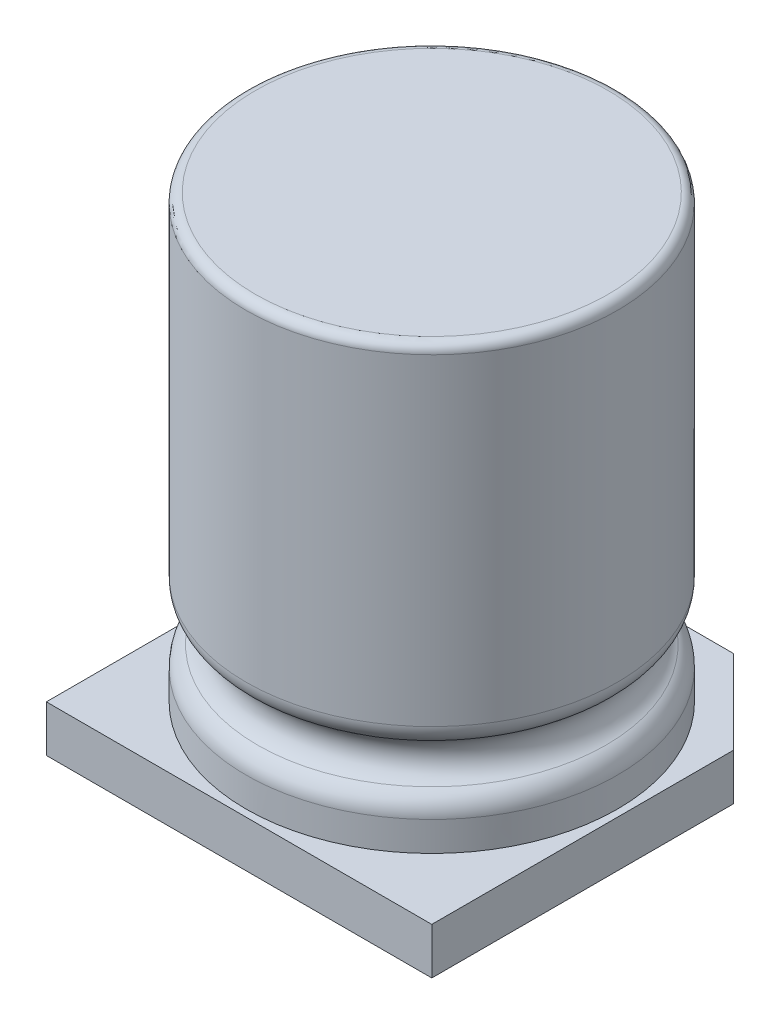
ISO-10303-21;
HEADER;
FILE_DESCRIPTION(('STEP AP214'),'2;1');
FILE_NAME('part.step','',(''),(''),'','','');
FILE_SCHEMA(('AUTOMOTIVE_DESIGN { 1 0 10303 214 1 1 1 1 }'));
ENDSEC;
DATA;
#1=APPLICATION_CONTEXT('core data for automotive mechanical design processes');
#2=APPLICATION_PROTOCOL_DEFINITION('international standard','automotive_design',2000,#1);
#3=PRODUCT_CONTEXT('',#1,'mechanical');
#4=PRODUCT('Part','Part','',(#3));
#5=PRODUCT_RELATED_PRODUCT_CATEGORY('part','',(#4));
#6=PRODUCT_DEFINITION_FORMATION('','',#4);
#7=PRODUCT_DEFINITION_CONTEXT('part definition',#1,'design');
#8=PRODUCT_DEFINITION('design','',#6,#7);
#9=PRODUCT_DEFINITION_SHAPE('','',#8);
#10=(LENGTH_UNIT() NAMED_UNIT(*) SI_UNIT(.MILLI.,.METRE.));
#11=(NAMED_UNIT(*) PLANE_ANGLE_UNIT() SI_UNIT($,.RADIAN.));
#12=(NAMED_UNIT(*) SI_UNIT($,.STERADIAN.) SOLID_ANGLE_UNIT());
#13=UNCERTAINTY_MEASURE_WITH_UNIT(LENGTH_MEASURE(1.E-05),#10,'distance_accuracy_value','');
#14=(GEOMETRIC_REPRESENTATION_CONTEXT(3) GLOBAL_UNCERTAINTY_ASSIGNED_CONTEXT((#13)) GLOBAL_UNIT_ASSIGNED_CONTEXT((#10,
#11,#12)) REPRESENTATION_CONTEXT('',''));
#15=CARTESIAN_POINT('',(0.,0.,0.));
#16=DIRECTION('',(0.,0.,1.));
#17=DIRECTION('',(1.,0.,0.));
#18=AXIS2_PLACEMENT_3D('',#15,#16,#17);
#19=CARTESIAN_POINT('',(0.,10.5,0.));
#20=DIRECTION('',(0.,-1.,0.));
#21=DIRECTION('',(0.,0.,-1.));
#22=AXIS2_PLACEMENT_3D('',#19,#20,#21);
#23=CYLINDRICAL_SURFACE('',#22,4.);
#24=CARTESIAN_POINT('',(0.,10.3,0.));
#25=DIRECTION('',(0.,1.,0.));
#26=DIRECTION('',(0.,0.,1.));
#27=AXIS2_PLACEMENT_3D('',#24,#25,#26);
#28=CIRCLE('',#27,4.);
#29=CARTESIAN_POINT('',(0.,10.3,4.));
#30=VERTEX_POINT('',#29);
#31=EDGE_CURVE('E11',#30,#30,#28,.F.);
#32=ORIENTED_EDGE('',*,*,#31,.T.);
#33=EDGE_LOOP('',(#32));
#34=FACE_BOUND('',#33,.T.);
#35=CARTESIAN_POINT('',(0.,3.36602540378466,0.));
#36=DIRECTION('',(0.,1.,0.));
#37=DIRECTION('',(0.,0.,1.));
#38=AXIS2_PLACEMENT_3D('',#35,#36,#37);
#39=CIRCLE('',#38,4.);
#40=CARTESIAN_POINT('',(0.,3.36602540378466,4.));
#41=VERTEX_POINT('',#40);
#42=EDGE_CURVE('E55',#41,#41,#39,.T.);
#43=ORIENTED_EDGE('',*,*,#42,.T.);
#44=EDGE_LOOP('',(#43));
#45=FACE_BOUND('',#44,.T.);
#46=ADVANCED_FACE('F40',(#34,#45),#23,.T.);
#47=CARTESIAN_POINT('',(0.,10.5,0.));
#48=DIRECTION('',(0.,1.,0.));
#49=DIRECTION('',(0.,0.,1.));
#50=AXIS2_PLACEMENT_3D('',#47,#48,#49);
#51=PLANE('',#50);
#52=CARTESIAN_POINT('',(0.,10.5,0.));
#53=DIRECTION('',(0.,1.,0.));
#54=DIRECTION('',(0.,0.,1.));
#55=AXIS2_PLACEMENT_3D('',#52,#53,#54);
#56=CIRCLE('',#55,3.8);
#57=CARTESIAN_POINT('',(0.,10.5,3.8));
#58=VERTEX_POINT('',#57);
#59=EDGE_CURVE('E47',#58,#58,#56,.T.);
#60=ORIENTED_EDGE('',*,*,#59,.T.);
#61=EDGE_LOOP('',(#60));
#62=FACE_BOUND('',#61,.T.);
#63=ADVANCED_FACE('F83',(#62),#51,.T.);
#64=CARTESIAN_POINT('',(0.,2.5,0.));
#65=DIRECTION('',(0.,1.,0.));
#66=DIRECTION('',(0.,0.,1.));
#67=AXIS2_PLACEMENT_3D('',#64,#65,#66);
#68=TOROIDAL_SURFACE('',#67,4.,0.5);
#69=CARTESIAN_POINT('',(0.,2.93301270189225,0.));
#70=DIRECTION('',(0.,-1.,0.));
#71=DIRECTION('',(0.,0.,-1.));
#72=AXIS2_PLACEMENT_3D('',#69,#70,#71);
#73=CIRCLE('',#72,3.75000000000008);
#74=CARTESIAN_POINT('',(0.,2.93301270189225,-3.75000000000008));
#75=VERTEX_POINT('',#74);
#76=EDGE_CURVE('E60',#75,#75,#73,.T.);
#77=ORIENTED_EDGE('',*,*,#76,.T.);
#78=EDGE_LOOP('',(#77));
#79=FACE_BOUND('',#78,.T.);
#80=CARTESIAN_POINT('',(0.,2.06698729810775,0.));
#81=DIRECTION('',(0.,1.,0.));
#82=DIRECTION('',(0.,0.,1.));
#83=AXIS2_PLACEMENT_3D('',#80,#81,#82);
#84=CIRCLE('',#83,3.75000000000008);
#85=CARTESIAN_POINT('',(0.,2.06698729810775,3.75000000000008));
#86=VERTEX_POINT('',#85);
#87=EDGE_CURVE('E63',#86,#86,#84,.T.);
#88=ORIENTED_EDGE('',*,*,#87,.T.);
#89=EDGE_LOOP('',(#88));
#90=FACE_BOUND('',#89,.T.);
#91=ADVANCED_FACE('F74',(#79,#90),#68,.F.);
#92=CARTESIAN_POINT('',(0.,1.,0.));
#93=DIRECTION('',(0.,1.,0.));
#94=DIRECTION('',(0.,0.,1.));
#95=AXIS2_PLACEMENT_3D('',#92,#93,#94);
#96=PLANE('',#95);
#97=CARTESIAN_POINT('',(0.,1.,0.));
#98=DIRECTION('',(0.,1.,0.));
#99=DIRECTION('',(0.,0.,1.));
#100=AXIS2_PLACEMENT_3D('',#97,#98,#99);
#101=CIRCLE('',#100,4.);
#102=CARTESIAN_POINT('',(0.,1.,4.));
#103=VERTEX_POINT('',#102);
#104=EDGE_CURVE('E66',#103,#103,#101,.T.);
#105=ORIENTED_EDGE('',*,*,#104,.F.);
#106=EDGE_LOOP('',(#105));
#107=FACE_BOUND('',#106,.T.);
#108=ADVANCED_FACE('F72',(#107),#96,.F.);
#109=CARTESIAN_POINT('',(0.,1.63397459621534,0.));
#110=DIRECTION('',(0.,-1.,0.));
#111=DIRECTION('',(0.,0.,-1.));
#112=AXIS2_PLACEMENT_3D('',#109,#110,#111);
#113=CIRCLE('',#112,4.);
#114=CARTESIAN_POINT('',(0.,1.63397459621534,-4.));
#115=VERTEX_POINT('',#114);
#116=EDGE_CURVE('E51',#115,#115,#113,.T.);
#117=ORIENTED_EDGE('',*,*,#116,.T.);
#118=EDGE_LOOP('',(#117));
#119=FACE_BOUND('',#118,.T.);
#120=ORIENTED_EDGE('',*,*,#104,.T.);
#121=EDGE_LOOP('',(#120));
#122=FACE_BOUND('',#121,.T.);
#123=ADVANCED_FACE('F70',(#119,#122),#23,.T.);
#124=CARTESIAN_POINT('',(0.,3.36602540378466,0.));
#125=DIRECTION('',(0.,1.,0.));
#126=DIRECTION('',(0.,0.,1.));
#127=AXIS2_PLACEMENT_3D('',#124,#125,#126);
#128=TOROIDAL_SURFACE('',#127,3.50000000000008,0.5);
#129=ORIENTED_EDGE('',*,*,#42,.F.);
#130=EDGE_LOOP('',(#129));
#131=FACE_BOUND('',#130,.T.);
#132=ORIENTED_EDGE('',*,*,#76,.F.);
#133=EDGE_LOOP('',(#132));
#134=FACE_BOUND('',#133,.T.);
#135=ADVANCED_FACE('F80',(#131,#134),#128,.T.);
#136=CARTESIAN_POINT('',(0.,1.63397459621534,0.));
#137=DIRECTION('',(0.,-1.,0.));
#138=DIRECTION('',(0.,0.,-1.));
#139=AXIS2_PLACEMENT_3D('',#136,#137,#138);
#140=TOROIDAL_SURFACE('',#139,3.50000000000008,0.5);
#141=ORIENTED_EDGE('',*,*,#116,.F.);
#142=EDGE_LOOP('',(#141));
#143=FACE_BOUND('',#142,.T.);
#144=ORIENTED_EDGE('',*,*,#87,.F.);
#145=EDGE_LOOP('',(#144));
#146=FACE_BOUND('',#145,.T.);
#147=ADVANCED_FACE('F94',(#143,#146),#140,.T.);
#148=CARTESIAN_POINT('',(0.,10.3,0.));
#149=DIRECTION('',(0.,1.,0.));
#150=DIRECTION('',(0.,0.,1.));
#151=AXIS2_PLACEMENT_3D('',#148,#149,#150);
#152=TOROIDAL_SURFACE('',#151,3.8,0.2);
#153=ORIENTED_EDGE('',*,*,#31,.F.);
#154=EDGE_LOOP('',(#153));
#155=FACE_BOUND('',#154,.T.);
#156=ORIENTED_EDGE('',*,*,#59,.F.);
#157=EDGE_LOOP('',(#156));
#158=FACE_BOUND('',#157,.T.);
#159=ADVANCED_FACE('F42',(#155,#158),#152,.T.);
#160=CLOSED_SHELL('',(#46,#63,#91,#108,#123,#135,#147,#159));
#161=MANIFOLD_SOLID_BREP('B2',#160);
#162=CARTESIAN_POINT('',(4.15,1.,-4.15));
#163=DIRECTION('',(-1.,0.,0.));
#164=DIRECTION('',(0.,0.,1.));
#165=AXIS2_PLACEMENT_3D('',#162,#163,#164);
#166=PLANE('',#165);
#167=DIRECTION('',(0.,0.,-1.));
#168=VECTOR('',#167,1.);
#169=CARTESIAN_POINT('',(4.15,0.,-4.15));
#170=LINE('',#169,#168);
#171=CARTESIAN_POINT('',(4.15,0.,4.15));
#172=VERTEX_POINT('',#171);
#173=CARTESIAN_POINT('',(4.15,0.,-2.34999999999999));
#174=VERTEX_POINT('',#173);
#175=EDGE_CURVE('E233',#172,#174,#170,.T.);
#176=ORIENTED_EDGE('',*,*,#175,.T.);
#177=DIRECTION('',(0.,1.,0.));
#178=VECTOR('',#177,1.);
#179=CARTESIAN_POINT('',(4.15,1.,-2.34999999999999));
#180=LINE('',#179,#178);
#181=CARTESIAN_POINT('',(4.15,1.,-2.34999999999999));
#182=VERTEX_POINT('',#181);
#183=EDGE_CURVE('E177',#174,#182,#180,.T.);
#184=ORIENTED_EDGE('',*,*,#183,.T.);
#185=DIRECTION('',(0.,0.,-1.));
#186=VECTOR('',#185,1.);
#187=CARTESIAN_POINT('',(4.15,1.,-4.15));
#188=LINE('',#187,#186);
#189=CARTESIAN_POINT('',(4.15,1.,4.15));
#190=VERTEX_POINT('',#189);
#191=EDGE_CURVE('E240',#190,#182,#188,.T.);
#192=ORIENTED_EDGE('',*,*,#191,.F.);
#193=DIRECTION('',(0.,-1.,0.));
#194=VECTOR('',#193,1.);
#195=CARTESIAN_POINT('',(4.15,1.,4.15));
#196=LINE('',#195,#194);
#197=EDGE_CURVE('E225',#190,#172,#196,.T.);
#198=ORIENTED_EDGE('',*,*,#197,.T.);
#199=EDGE_LOOP('',(#176,#184,#192,#198));
#200=FACE_BOUND('',#199,.T.);
#201=ADVANCED_FACE('F154',(#200),#166,.F.);
#202=CARTESIAN_POINT('',(-4.15,1.,-4.15));
#203=DIRECTION('',(0.,0.,1.));
#204=DIRECTION('',(1.,0.,0.));
#205=AXIS2_PLACEMENT_3D('',#202,#203,#204);
#206=PLANE('',#205);
#207=DIRECTION('',(-1.,0.,0.));
#208=VECTOR('',#207,1.);
#209=CARTESIAN_POINT('',(-4.15,1.,-4.15));
#210=LINE('',#209,#208);
#211=CARTESIAN_POINT('',(2.35,1.,-4.15));
#212=VERTEX_POINT('',#211);
#213=CARTESIAN_POINT('',(-2.34999999999999,1.,-4.15));
#214=VERTEX_POINT('',#213);
#215=EDGE_CURVE('E215',#212,#214,#210,.T.);
#216=ORIENTED_EDGE('',*,*,#215,.F.);
#217=DIRECTION('',(0.,-1.,0.));
#218=VECTOR('',#217,1.);
#219=CARTESIAN_POINT('',(2.35,1.,-4.15));
#220=LINE('',#219,#218);
#221=CARTESIAN_POINT('',(2.35,0.,-4.15));
#222=VERTEX_POINT('',#221);
#223=EDGE_CURVE('E243',#212,#222,#220,.T.);
#224=ORIENTED_EDGE('',*,*,#223,.T.);
#225=DIRECTION('',(-1.,0.,0.));
#226=VECTOR('',#225,1.);
#227=CARTESIAN_POINT('',(-4.15,0.,-4.15));
#228=LINE('',#227,#226);
#229=CARTESIAN_POINT('',(-2.34999999999999,0.,-4.15));
#230=VERTEX_POINT('',#229);
#231=EDGE_CURVE('E235',#222,#230,#228,.T.);
#232=ORIENTED_EDGE('',*,*,#231,.T.);
#233=DIRECTION('',(0.,1.,0.));
#234=VECTOR('',#233,1.);
#235=CARTESIAN_POINT('',(-2.34999999999999,1.,-4.15));
#236=LINE('',#235,#234);
#237=EDGE_CURVE('E224',#230,#214,#236,.T.);
#238=ORIENTED_EDGE('',*,*,#237,.T.);
#239=EDGE_LOOP('',(#216,#224,#232,#238));
#240=FACE_BOUND('',#239,.T.);
#241=ADVANCED_FACE('F256',(#240),#206,.F.);
#242=CARTESIAN_POINT('',(-4.15,1.,-4.15));
#243=DIRECTION('',(1.,0.,0.));
#244=DIRECTION('',(0.,0.,-1.));
#245=AXIS2_PLACEMENT_3D('',#242,#243,#244);
#246=PLANE('',#245);
#247=DIRECTION('',(0.,0.,1.));
#248=VECTOR('',#247,1.);
#249=CARTESIAN_POINT('',(-4.15,1.,-4.15));
#250=LINE('',#249,#248);
#251=CARTESIAN_POINT('',(-4.15,1.,-2.35));
#252=VERTEX_POINT('',#251);
#253=CARTESIAN_POINT('',(-4.15,1.,4.15));
#254=VERTEX_POINT('',#253);
#255=EDGE_CURVE('E207',#252,#254,#250,.T.);
#256=ORIENTED_EDGE('',*,*,#255,.F.);
#257=DIRECTION('',(0.,-1.,0.));
#258=VECTOR('',#257,1.);
#259=CARTESIAN_POINT('',(-4.15,1.,-2.35));
#260=LINE('',#259,#258);
#261=CARTESIAN_POINT('',(-4.15,0.,-2.35));
#262=VERTEX_POINT('',#261);
#263=EDGE_CURVE('E38',#252,#262,#260,.T.);
#264=ORIENTED_EDGE('',*,*,#263,.T.);
#265=DIRECTION('',(0.,0.,1.));
#266=VECTOR('',#265,1.);
#267=CARTESIAN_POINT('',(-4.15,0.,-4.15));
#268=LINE('',#267,#266);
#269=CARTESIAN_POINT('',(-4.15,0.,4.15));
#270=VERTEX_POINT('',#269);
#271=EDGE_CURVE('E221',#262,#270,#268,.T.);
#272=ORIENTED_EDGE('',*,*,#271,.T.);
#273=DIRECTION('',(0.,-1.,0.));
#274=VECTOR('',#273,1.);
#275=CARTESIAN_POINT('',(-4.15,1.,4.15));
#276=LINE('',#275,#274);
#277=EDGE_CURVE('E218',#254,#270,#276,.T.);
#278=ORIENTED_EDGE('',*,*,#277,.F.);
#279=EDGE_LOOP('',(#256,#264,#272,#278));
#280=FACE_BOUND('',#279,.T.);
#281=ADVANCED_FACE('F219',(#280),#246,.F.);
#282=CARTESIAN_POINT('',(-4.15,1.,4.15));
#283=DIRECTION('',(0.,0.,-1.));
#284=DIRECTION('',(-1.,0.,0.));
#285=AXIS2_PLACEMENT_3D('',#282,#283,#284);
#286=PLANE('',#285);
#287=DIRECTION('',(1.,0.,0.));
#288=VECTOR('',#287,1.);
#289=CARTESIAN_POINT('',(-4.15,0.,4.15));
#290=LINE('',#289,#288);
#291=EDGE_CURVE('E239',#270,#172,#290,.T.);
#292=ORIENTED_EDGE('',*,*,#291,.T.);
#293=ORIENTED_EDGE('',*,*,#197,.F.);
#294=DIRECTION('',(1.,0.,0.));
#295=VECTOR('',#294,1.);
#296=CARTESIAN_POINT('',(-4.15,1.,4.15));
#297=LINE('',#296,#295);
#298=EDGE_CURVE('E211',#254,#190,#297,.T.);
#299=ORIENTED_EDGE('',*,*,#298,.F.);
#300=ORIENTED_EDGE('',*,*,#277,.T.);
#301=EDGE_LOOP('',(#292,#293,#299,#300));
#302=FACE_BOUND('',#301,.T.);
#303=ADVANCED_FACE('F227',(#302),#286,.F.);
#304=CARTESIAN_POINT('',(0.,1.,0.));
#305=DIRECTION('',(0.,1.,0.));
#306=DIRECTION('',(0.,0.,1.));
#307=AXIS2_PLACEMENT_3D('',#304,#305,#306);
#308=PLANE('',#307);
#309=ORIENTED_EDGE('',*,*,#191,.T.);
#310=DIRECTION('',(0.707106781186547,0.,0.707106781186548));
#311=VECTOR('',#310,1.);
#312=CARTESIAN_POINT('',(3.25,1.,-3.24999999999999));
#313=LINE('',#312,#311);
#314=EDGE_CURVE('E162',#182,#212,#313,.F.);
#315=ORIENTED_EDGE('',*,*,#314,.T.);
#316=ORIENTED_EDGE('',*,*,#215,.T.);
#317=DIRECTION('',(0.707106781186549,0.,-0.707106781186547));
#318=VECTOR('',#317,1.);
#319=CARTESIAN_POINT('',(-3.24999999999999,1.,-3.25));
#320=LINE('',#319,#318);
#321=EDGE_CURVE('E169',#214,#252,#320,.F.);
#322=ORIENTED_EDGE('',*,*,#321,.T.);
#323=ORIENTED_EDGE('',*,*,#255,.T.);
#324=ORIENTED_EDGE('',*,*,#298,.T.);
#325=EDGE_LOOP('',(#309,#315,#316,#322,#323,#324));
#326=FACE_BOUND('',#325,.T.);
#327=ADVANCED_FACE('F209',(#326),#308,.T.);
#328=CARTESIAN_POINT('',(0.,0.,0.));
#329=DIRECTION('',(0.,1.,0.));
#330=DIRECTION('',(0.,0.,1.));
#331=AXIS2_PLACEMENT_3D('',#328,#329,#330);
#332=PLANE('',#331);
#333=ORIENTED_EDGE('',*,*,#231,.F.);
#334=DIRECTION('',(-0.707106781186547,0.,-0.707106781186548));
#335=VECTOR('',#334,1.);
#336=CARTESIAN_POINT('',(2.35,0.,-4.15));
#337=LINE('',#336,#335);
#338=EDGE_CURVE('E248',#222,#174,#337,.F.);
#339=ORIENTED_EDGE('',*,*,#338,.T.);
#340=ORIENTED_EDGE('',*,*,#175,.F.);
#341=ORIENTED_EDGE('',*,*,#291,.F.);
#342=ORIENTED_EDGE('',*,*,#271,.F.);
#343=DIRECTION('',(-0.707106781186549,0.,0.707106781186547));
#344=VECTOR('',#343,1.);
#345=CARTESIAN_POINT('',(-4.15,0.,-2.35));
#346=LINE('',#345,#344);
#347=EDGE_CURVE('E246',#262,#230,#346,.F.);
#348=ORIENTED_EDGE('',*,*,#347,.T.);
#349=EDGE_LOOP('',(#333,#339,#340,#341,#342,#348));
#350=FACE_BOUND('',#349,.T.);
#351=ADVANCED_FACE('F262',(#350),#332,.F.);
#352=CARTESIAN_POINT('',(2.35,1.,-4.15));
#353=DIRECTION('',(-0.707106781186548,0.,0.707106781186547));
#354=DIRECTION('',(0.,-1.,0.));
#355=AXIS2_PLACEMENT_3D('',#352,#353,#354);
#356=PLANE('',#355);
#357=ORIENTED_EDGE('',*,*,#314,.F.);
#358=ORIENTED_EDGE('',*,*,#183,.F.);
#359=ORIENTED_EDGE('',*,*,#338,.F.);
#360=ORIENTED_EDGE('',*,*,#223,.F.);
#361=EDGE_LOOP('',(#357,#358,#359,#360));
#362=FACE_BOUND('',#361,.T.);
#363=ADVANCED_FACE('F259',(#362),#356,.F.);
#364=CARTESIAN_POINT('',(-4.15,1.,-2.35));
#365=DIRECTION('',(0.707106781186546,0.,0.707106781186548));
#366=DIRECTION('',(0.,-1.,0.));
#367=AXIS2_PLACEMENT_3D('',#364,#365,#366);
#368=PLANE('',#367);
#369=ORIENTED_EDGE('',*,*,#321,.F.);
#370=ORIENTED_EDGE('',*,*,#237,.F.);
#371=ORIENTED_EDGE('',*,*,#347,.F.);
#372=ORIENTED_EDGE('',*,*,#263,.F.);
#373=EDGE_LOOP('',(#369,#370,#371,#372));
#374=FACE_BOUND('',#373,.T.);
#375=ADVANCED_FACE('F156',(#374),#368,.F.);
#376=CLOSED_SHELL('',(#201,#241,#281,#303,#327,#351,#363,#375));
#377=MANIFOLD_SOLID_BREP('B6',#376);
#378=ADVANCED_BREP_SHAPE_REPRESENTATION('',(#18,#161,#377),#14);
#379=SHAPE_DEFINITION_REPRESENTATION(#9,#378);
ENDSEC;
END-ISO-10303-21;
